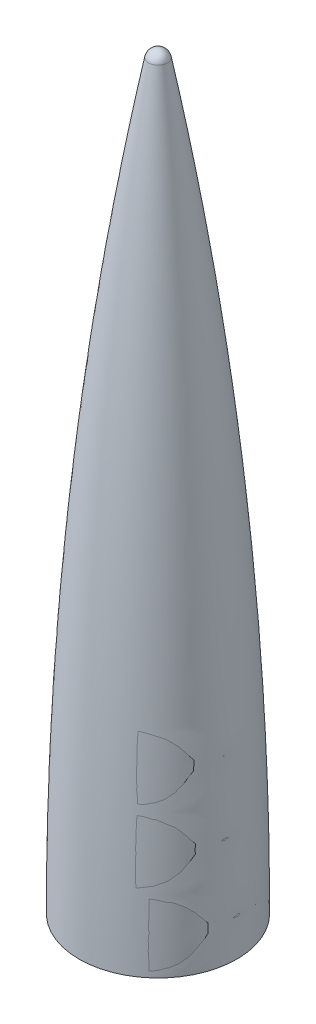
ISO-10303-21;
HEADER;
FILE_DESCRIPTION(('STEP AP214'),'2;1');
FILE_NAME('part.step','',(''),(''),'','','');
FILE_SCHEMA(('AUTOMOTIVE_DESIGN { 1 0 10303 214 1 1 1 1 }'));
ENDSEC;
DATA;
#1=APPLICATION_CONTEXT('core data for automotive mechanical design processes');
#2=APPLICATION_PROTOCOL_DEFINITION('international standard','automotive_design',2000,#1);
#3=PRODUCT_CONTEXT('',#1,'mechanical');
#4=PRODUCT('Part','Part','',(#3));
#5=PRODUCT_RELATED_PRODUCT_CATEGORY('part','',(#4));
#6=PRODUCT_DEFINITION_FORMATION('','',#4);
#7=PRODUCT_DEFINITION_CONTEXT('part definition',#1,'design');
#8=PRODUCT_DEFINITION('design','',#6,#7);
#9=PRODUCT_DEFINITION_SHAPE('','',#8);
#10=(LENGTH_UNIT() NAMED_UNIT(*) SI_UNIT(.MILLI.,.METRE.));
#11=(NAMED_UNIT(*) PLANE_ANGLE_UNIT() SI_UNIT($,.RADIAN.));
#12=(NAMED_UNIT(*) SI_UNIT($,.STERADIAN.) SOLID_ANGLE_UNIT());
#13=UNCERTAINTY_MEASURE_WITH_UNIT(LENGTH_MEASURE(1.E-05),#10,'distance_accuracy_value','');
#14=(GEOMETRIC_REPRESENTATION_CONTEXT(3) GLOBAL_UNCERTAINTY_ASSIGNED_CONTEXT((#13)) GLOBAL_UNIT_ASSIGNED_CONTEXT((#10,
#11,#12)) REPRESENTATION_CONTEXT('',''));
#15=CARTESIAN_POINT('',(0.,0.,0.));
#16=DIRECTION('',(0.,0.,1.));
#17=DIRECTION('',(1.,0.,0.));
#18=AXIS2_PLACEMENT_3D('',#15,#16,#17);
#19=CARTESIAN_POINT('',(0.,0.,0.));
#20=DIRECTION('',(0.,1.,0.));
#21=DIRECTION('',(0.,0.,1.));
#22=AXIS2_PLACEMENT_3D('',#19,#20,#21);
#23=CONICAL_SURFACE('',#22,78.359,1.57057960520912);
#24=CARTESIAN_POINT('',(0.,0.,0.));
#25=DIRECTION('',(0.,1.,0.));
#26=DIRECTION('',(0.,0.,1.));
#27=AXIS2_PLACEMENT_3D('',#24,#25,#26);
#28=CIRCLE('',#27,78.359);
#29=CARTESIAN_POINT('',(0.,0.,78.359));
#30=VERTEX_POINT('',#29);
#31=EDGE_CURVE('E11',#30,#30,#28,.T.);
#32=ORIENTED_EDGE('',*,*,#31,.F.);
#33=EDGE_LOOP('',(#32));
#34=FACE_BOUND('',#33,.T.);
#35=CARTESIAN_POINT('',(0.,-0.000473406628266088,0.));
#36=DIRECTION('',(0.,1.,0.));
#37=DIRECTION('',(1.,0.,0.));
#38=AXIS2_PLACEMENT_3D('',#35,#36,#37);
#39=CIRCLE('',#38,76.1746000512987);
#40=CARTESIAN_POINT('',(76.1746000512987,-0.000473406628266088,0.));
#41=VERTEX_POINT('',#40);
#42=EDGE_CURVE('E52',#41,#41,#39,.T.);
#43=ORIENTED_EDGE('',*,*,#42,.T.);
#44=EDGE_LOOP('',(#43));
#45=FACE_BOUND('',#44,.T.);
#46=ADVANCED_FACE('F38',(#34,#45),#23,.T.);
#47=CARTESIAN_POINT('',(9.36237246855732,735.7364,0.));
#48=CARTESIAN_POINT('',(10.3387136494369,730.52079473252,0.));
#49=CARTESIAN_POINT('',(13.716822230186,712.626522220949,0.));
#50=CARTESIAN_POINT('',(22.9910345486454,660.935019547579,0.));
#51=CARTESIAN_POINT('',(41.4152839025534,546.958592129898,0.));
#52=CARTESIAN_POINT('',(69.1105444157282,320.081789011864,0.));
#53=CARTESIAN_POINT('',(78.3317113401796,125.915742519726,0.));
#54=CARTESIAN_POINT('',(78.359,0.,0.));
#55=B_SPLINE_CURVE_WITH_KNOTS('',3,(#47,#48,#49,#50,#51,#52,#53,#54),.UNSPECIFIED.,.F.,.F.,(4,1,
1,1,1,4),(0.,0.0215122090856733,0.073827546013236,0.212907599312791,0.489545677917576,1.),.UNSPECIFIED.);
#56=CARTESIAN_POINT('',(0.,0.,0.));
#57=DIRECTION('',(0.,1.,0.));
#58=AXIS1_PLACEMENT('',#56,#57);
#59=SURFACE_OF_REVOLUTION('',#55,#58);
#60=ORIENTED_EDGE('',*,*,#31,.T.);
#61=EDGE_LOOP('',(#60));
#62=FACE_BOUND('',#61,.T.);
#63=CARTESIAN_POINT('',(0.,735.7364,0.));
#64=DIRECTION('',(0.,1.,0.));
#65=DIRECTION('',(0.,0.,1.));
#66=AXIS2_PLACEMENT_3D('',#63,#64,#65);
#67=CIRCLE('',#66,9.36237246855732);
#68=CARTESIAN_POINT('',(0.,735.7364,9.36237246855732));
#69=VERTEX_POINT('',#68);
#70=EDGE_CURVE('E47',#69,#69,#67,.T.);
#71=ORIENTED_EDGE('',*,*,#70,.F.);
#72=EDGE_LOOP('',(#71));
#73=FACE_BOUND('',#72,.T.);
#74=ADVANCED_FACE('F74',(#62,#73),#59,.F.);
#75=CARTESIAN_POINT('',(0.,733.9838,0.));
#76=DIRECTION('',(0.,1.,0.));
#77=DIRECTION('',(1.,0.,0.));
#78=AXIS2_PLACEMENT_3D('',#75,#76,#77);
#79=SPHERICAL_SURFACE('',#78,9.525);
#80=ORIENTED_EDGE('',*,*,#70,.T.);
#81=EDGE_LOOP('',(#80));
#82=FACE_BOUND('',#81,.T.);
#83=ADVANCED_FACE('F65',(#82),#79,.T.);
#84=CARTESIAN_POINT('',(9.36237246855732,735.7364,0.));
#85=CARTESIAN_POINT('',(10.3387136494369,730.52079473252,0.));
#86=CARTESIAN_POINT('',(13.716822230186,712.626522220949,0.));
#87=CARTESIAN_POINT('',(22.9910345486454,660.935019547579,0.));
#88=CARTESIAN_POINT('',(41.4152839025534,546.958592129898,0.));
#89=CARTESIAN_POINT('',(69.1105444157282,320.081789011864,0.));
#90=CARTESIAN_POINT('',(78.3317113401796,125.915742519726,0.));
#91=CARTESIAN_POINT('',(78.359,0.,0.));
#92=B_SPLINE_CURVE_WITH_KNOTS('',3,(#84,#85,#86,#87,#88,#89,#90,#91),.UNSPECIFIED.,.F.,.F.,(4,1,
1,1,1,4),(0.,0.0215122090856733,0.073827546013236,0.212907599312791,0.489545677917576,1.),.UNSPECIFIED.);
#93=CARTESIAN_POINT('',(0.,0.,0.));
#94=DIRECTION('',(0.,1.,0.));
#95=AXIS1_PLACEMENT('',#93,#94);
#96=SURFACE_OF_REVOLUTION('',#92,#95);
#97=OFFSET_SURFACE('',#96,2.1844,.F.);
#98=ORIENTED_EDGE('',*,*,#42,.F.);
#99=EDGE_LOOP('',(#98));
#100=FACE_BOUND('',#99,.T.);
#101=CARTESIAN_POINT('',(0.,735.3344704,0.));
#102=DIRECTION('',(0.,1.,0.));
#103=DIRECTION('',(0.,0.,1.));
#104=AXIS2_PLACEMENT_3D('',#101,#102,#103);
#105=CIRCLE('',#104,7.21526838243484);
#106=CARTESIAN_POINT('',(0.,735.3344704,7.21526838243484));
#107=VERTEX_POINT('',#106);
#108=EDGE_CURVE('E55',#107,#107,#105,.T.);
#109=ORIENTED_EDGE('',*,*,#108,.T.);
#110=EDGE_LOOP('',(#109));
#111=FACE_BOUND('',#110,.T.);
#112=ADVANCED_FACE('F61',(#100,#111),#97,.T.);
#113=CARTESIAN_POINT('',(0.,733.9838,0.));
#114=DIRECTION('',(0.,1.,0.));
#115=DIRECTION('',(1.,0.,0.));
#116=AXIS2_PLACEMENT_3D('',#113,#114,#115);
#117=SPHERICAL_SURFACE('',#116,7.3406);
#118=ORIENTED_EDGE('',*,*,#108,.F.);
#119=EDGE_LOOP('',(#118));
#120=FACE_BOUND('',#119,.T.);
#121=ADVANCED_FACE('F64',(#120),#117,.F.);
#122=CLOSED_SHELL('',(#46,#74,#83,#112,#121));
#123=MANIFOLD_SOLID_BREP('B2',#122);
#124=ADVANCED_BREP_SHAPE_REPRESENTATION('',(#18,#123),#14);
#125=SHAPE_DEFINITION_REPRESENTATION(#9,#124);
ENDSEC;
END-ISO-10303-21;
